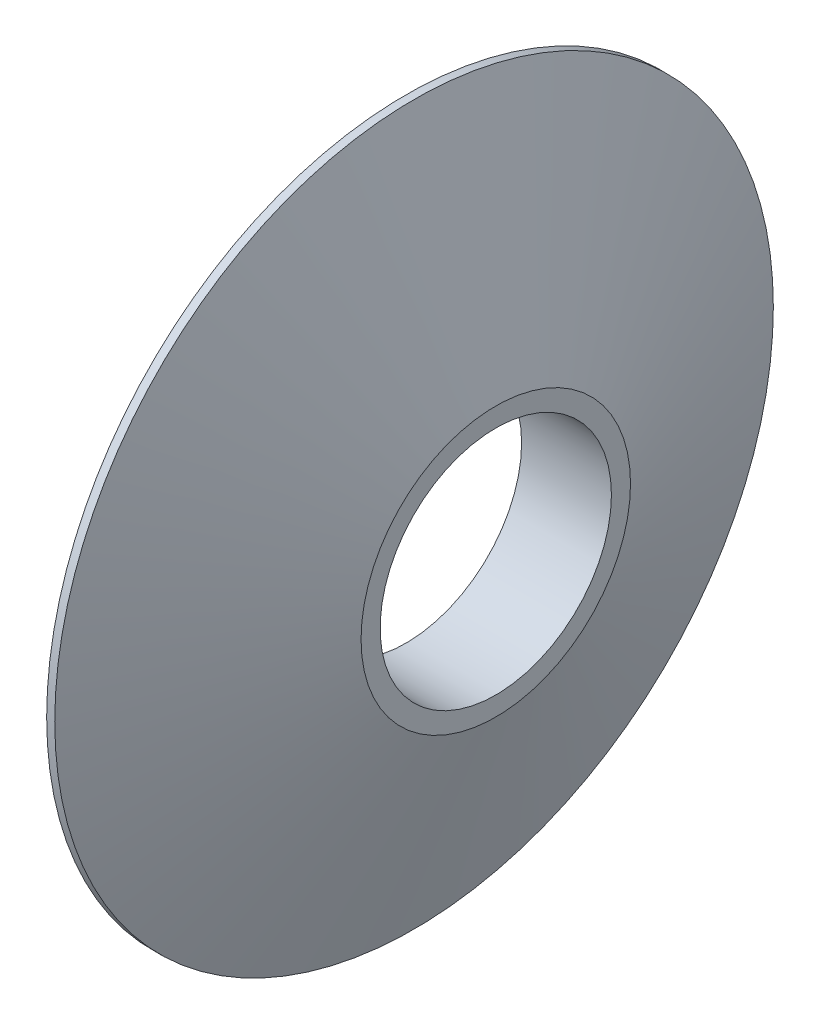
ISO-10303-21;
HEADER;
FILE_DESCRIPTION(('STEP AP214'),'2;1');
FILE_NAME('part.step','',(''),(''),'','','');
FILE_SCHEMA(('AUTOMOTIVE_DESIGN { 1 0 10303 214 1 1 1 1 }'));
ENDSEC;
DATA;
#1=APPLICATION_CONTEXT('core data for automotive mechanical design processes');
#2=APPLICATION_PROTOCOL_DEFINITION('international standard','automotive_design',2000,#1);
#3=PRODUCT_CONTEXT('',#1,'mechanical');
#4=PRODUCT('Part','Part','',(#3));
#5=PRODUCT_RELATED_PRODUCT_CATEGORY('part','',(#4));
#6=PRODUCT_DEFINITION_FORMATION('','',#4);
#7=PRODUCT_DEFINITION_CONTEXT('part definition',#1,'design');
#8=PRODUCT_DEFINITION('design','',#6,#7);
#9=PRODUCT_DEFINITION_SHAPE('','',#8);
#10=(LENGTH_UNIT() NAMED_UNIT(*) SI_UNIT(.MILLI.,.METRE.));
#11=(NAMED_UNIT(*) PLANE_ANGLE_UNIT() SI_UNIT($,.RADIAN.));
#12=(NAMED_UNIT(*) SI_UNIT($,.STERADIAN.) SOLID_ANGLE_UNIT());
#13=UNCERTAINTY_MEASURE_WITH_UNIT(LENGTH_MEASURE(1.E-05),#10,'distance_accuracy_value','');
#14=(GEOMETRIC_REPRESENTATION_CONTEXT(3) GLOBAL_UNCERTAINTY_ASSIGNED_CONTEXT((#13)) GLOBAL_UNIT_ASSIGNED_CONTEXT((#10,
#11,#12)) REPRESENTATION_CONTEXT('',''));
#15=CARTESIAN_POINT('',(0.,0.,0.));
#16=DIRECTION('',(0.,0.,1.));
#17=DIRECTION('',(1.,0.,0.));
#18=AXIS2_PLACEMENT_3D('',#15,#16,#17);
#19=CARTESIAN_POINT('',(0.,0.,0.));
#20=DIRECTION('',(1.,0.,0.));
#21=DIRECTION('',(0.,0.,-1.));
#22=AXIS2_PLACEMENT_3D('',#19,#20,#21);
#23=PLANE('',#22);
#24=CARTESIAN_POINT('',(0.,0.,0.));
#25=DIRECTION('',(1.,0.,0.));
#26=DIRECTION('',(0.,0.,-1.));
#27=AXIS2_PLACEMENT_3D('',#24,#25,#26);
#28=CIRCLE('',#27,2.575);
#29=CARTESIAN_POINT('',(0.,0.,-2.575));
#30=VERTEX_POINT('',#29);
#31=EDGE_CURVE('E54',#30,#30,#28,.T.);
#32=ORIENTED_EDGE('',*,*,#31,.T.);
#33=EDGE_LOOP('',(#32));
#34=FACE_BOUND('',#33,.T.);
#35=CARTESIAN_POINT('',(0.,0.,0.));
#36=DIRECTION('',(-1.,0.,0.));
#37=DIRECTION('',(0.,0.,1.));
#38=AXIS2_PLACEMENT_3D('',#35,#36,#37);
#39=CIRCLE('',#38,8.);
#40=CARTESIAN_POINT('',(0.,0.,8.));
#41=VERTEX_POINT('',#40);
#42=EDGE_CURVE('E10',#41,#41,#39,.T.);
#43=ORIENTED_EDGE('',*,*,#42,.T.);
#44=EDGE_LOOP('',(#43));
#45=FACE_BOUND('',#44,.T.);
#46=ADVANCED_FACE('F37',(#34,#45),#23,.F.);
#47=CARTESIAN_POINT('',(-13.2765957446808,0.,0.));
#48=DIRECTION('',(-1.,0.,0.));
#49=DIRECTION('',(0.,0.,1.));
#50=AXIS2_PLACEMENT_3D('',#47,#48,#49);
#51=CYLINDRICAL_SURFACE('',#50,8.);
#52=ORIENTED_EDGE('',*,*,#42,.F.);
#53=EDGE_LOOP('',(#52));
#54=FACE_BOUND('',#53,.T.);
#55=CARTESIAN_POINT('',(0.180148828668977,0.,0.));
#56=DIRECTION('',(-1.,0.,0.));
#57=DIRECTION('',(0.,0.,1.));
#58=AXIS2_PLACEMENT_3D('',#55,#56,#57);
#59=CIRCLE('',#58,8.);
#60=CARTESIAN_POINT('',(0.180148828668977,0.,8.));
#61=VERTEX_POINT('',#60);
#62=EDGE_CURVE('E44',#61,#61,#59,.T.);
#63=ORIENTED_EDGE('',*,*,#62,.T.);
#64=EDGE_LOOP('',(#63));
#65=FACE_BOUND('',#64,.T.);
#66=ADVANCED_FACE('F80',(#54,#65),#51,.T.);
#67=CARTESIAN_POINT('',(2.,0.,0.));
#68=DIRECTION('',(-1.,0.,0.));
#69=DIRECTION('',(0.,0.,1.));
#70=AXIS2_PLACEMENT_3D('',#67,#68,#69);
#71=CONICAL_SURFACE('',#70,3.,1.22173047639603);
#72=ORIENTED_EDGE('',*,*,#62,.F.);
#73=EDGE_LOOP('',(#72));
#74=FACE_BOUND('',#73,.T.);
#75=CARTESIAN_POINT('',(2.,0.,0.));
#76=DIRECTION('',(-1.,0.,0.));
#77=DIRECTION('',(0.,0.,1.));
#78=AXIS2_PLACEMENT_3D('',#75,#76,#77);
#79=CIRCLE('',#78,3.);
#80=CARTESIAN_POINT('',(2.,0.,3.));
#81=VERTEX_POINT('',#80);
#82=EDGE_CURVE('E49',#81,#81,#79,.T.);
#83=ORIENTED_EDGE('',*,*,#82,.T.);
#84=EDGE_LOOP('',(#83));
#85=FACE_BOUND('',#84,.T.);
#86=ADVANCED_FACE('F75',(#74,#85),#71,.T.);
#87=CARTESIAN_POINT('',(2.,3.,0.));
#88=DIRECTION('',(-1.,0.,0.));
#89=DIRECTION('',(0.,0.,1.));
#90=AXIS2_PLACEMENT_3D('',#87,#88,#89);
#91=PLANE('',#90);
#92=CARTESIAN_POINT('',(2.,0.,0.));
#93=DIRECTION('',(1.,0.,0.));
#94=DIRECTION('',(0.,0.,-1.));
#95=AXIS2_PLACEMENT_3D('',#92,#93,#94);
#96=CIRCLE('',#95,2.575);
#97=CARTESIAN_POINT('',(2.,0.,-2.575));
#98=VERTEX_POINT('',#97);
#99=EDGE_CURVE('E57',#98,#98,#96,.T.);
#100=ORIENTED_EDGE('',*,*,#99,.F.);
#101=EDGE_LOOP('',(#100));
#102=FACE_BOUND('',#101,.T.);
#103=ORIENTED_EDGE('',*,*,#82,.F.);
#104=EDGE_LOOP('',(#103));
#105=FACE_BOUND('',#104,.T.);
#106=ADVANCED_FACE('F69',(#102,#105),#91,.F.);
#107=CARTESIAN_POINT('',(0.,0.,0.));
#108=DIRECTION('',(1.,0.,0.));
#109=DIRECTION('',(0.,0.,-1.));
#110=AXIS2_PLACEMENT_3D('',#107,#108,#109);
#111=CYLINDRICAL_SURFACE('',#110,2.575);
#112=ORIENTED_EDGE('',*,*,#31,.F.);
#113=EDGE_LOOP('',(#112));
#114=FACE_BOUND('',#113,.T.);
#115=ORIENTED_EDGE('',*,*,#99,.T.);
#116=EDGE_LOOP('',(#115));
#117=FACE_BOUND('',#116,.T.);
#118=ADVANCED_FACE('F66',(#114,#117),#111,.F.);
#119=CLOSED_SHELL('',(#46,#66,#86,#106,#118));
#120=MANIFOLD_SOLID_BREP('B2',#119);
#121=ADVANCED_BREP_SHAPE_REPRESENTATION('',(#18,#120),#14);
#122=SHAPE_DEFINITION_REPRESENTATION(#9,#121);
ENDSEC;
END-ISO-10303-21;
